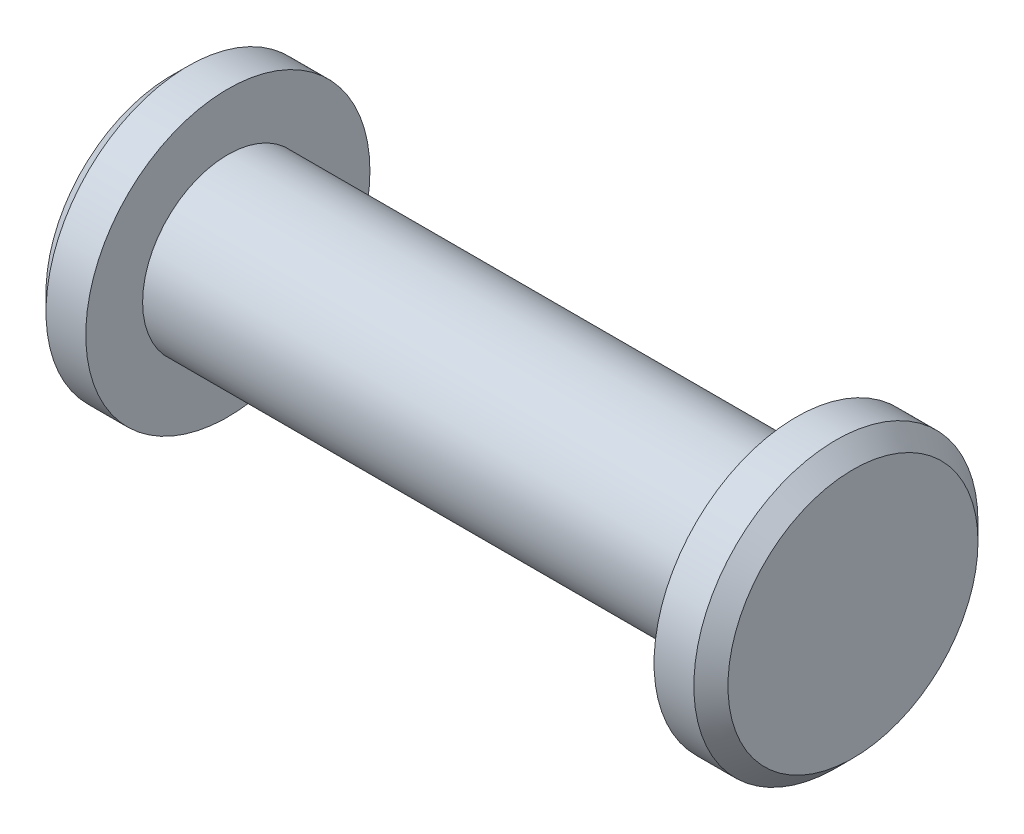
ISO-10303-21;
HEADER;
FILE_DESCRIPTION(('STEP AP214'),'2;1');
FILE_NAME('part.step','',(''),(''),'','','');
FILE_SCHEMA(('AUTOMOTIVE_DESIGN { 1 0 10303 214 1 1 1 1 }'));
ENDSEC;
DATA;
#1=APPLICATION_CONTEXT('core data for automotive mechanical design processes');
#2=APPLICATION_PROTOCOL_DEFINITION('international standard','automotive_design',2000,#1);
#3=PRODUCT_CONTEXT('',#1,'mechanical');
#4=PRODUCT('Part','Part','',(#3));
#5=PRODUCT_RELATED_PRODUCT_CATEGORY('part','',(#4));
#6=PRODUCT_DEFINITION_FORMATION('','',#4);
#7=PRODUCT_DEFINITION_CONTEXT('part definition',#1,'design');
#8=PRODUCT_DEFINITION('design','',#6,#7);
#9=PRODUCT_DEFINITION_SHAPE('','',#8);
#10=(LENGTH_UNIT() NAMED_UNIT(*) SI_UNIT(.MILLI.,.METRE.));
#11=(NAMED_UNIT(*) PLANE_ANGLE_UNIT() SI_UNIT($,.RADIAN.));
#12=(NAMED_UNIT(*) SI_UNIT($,.STERADIAN.) SOLID_ANGLE_UNIT());
#13=UNCERTAINTY_MEASURE_WITH_UNIT(LENGTH_MEASURE(1.E-05),#10,'distance_accuracy_value','');
#14=(GEOMETRIC_REPRESENTATION_CONTEXT(3) GLOBAL_UNCERTAINTY_ASSIGNED_CONTEXT((#13)) GLOBAL_UNIT_ASSIGNED_CONTEXT((#10,
#11,#12)) REPRESENTATION_CONTEXT('',''));
#15=CARTESIAN_POINT('',(0.,0.,0.));
#16=DIRECTION('',(0.,0.,1.));
#17=DIRECTION('',(1.,0.,0.));
#18=AXIS2_PLACEMENT_3D('',#15,#16,#17);
#19=CARTESIAN_POINT('',(50.,15.,0.));
#20=DIRECTION('',(-1.,0.,0.));
#21=DIRECTION('',(0.,0.,1.));
#22=AXIS2_PLACEMENT_3D('',#19,#20,#21);
#23=PLANE('',#22);
#24=CARTESIAN_POINT('',(50.,0.,0.));
#25=DIRECTION('',(1.,0.,0.));
#26=DIRECTION('',(0.,0.,-1.));
#27=AXIS2_PLACEMENT_3D('',#24,#25,#26);
#28=CIRCLE('',#27,15.);
#29=CARTESIAN_POINT('',(50.,0.,-15.));
#30=VERTEX_POINT('',#29);
#31=EDGE_CURVE('E72',#30,#30,#28,.T.);
#32=ORIENTED_EDGE('',*,*,#31,.T.);
#33=EDGE_LOOP('',(#32));
#34=FACE_BOUND('',#33,.T.);
#35=CARTESIAN_POINT('',(50.,0.,0.));
#36=DIRECTION('',(1.,0.,0.));
#37=DIRECTION('',(0.,0.,-1.));
#38=AXIS2_PLACEMENT_3D('',#35,#36,#37);
#39=CIRCLE('',#38,25.);
#40=CARTESIAN_POINT('',(50.,0.,-25.));
#41=VERTEX_POINT('',#40);
#42=EDGE_CURVE('E10',#41,#41,#39,.T.);
#43=ORIENTED_EDGE('',*,*,#42,.F.);
#44=EDGE_LOOP('',(#43));
#45=FACE_BOUND('',#44,.T.);
#46=ADVANCED_FACE('F37',(#34,#45),#23,.T.);
#47=CARTESIAN_POINT('',(60.,0.,0.));
#48=DIRECTION('',(1.,0.,0.));
#49=DIRECTION('',(0.,0.,-1.));
#50=AXIS2_PLACEMENT_3D('',#47,#48,#49);
#51=CYLINDRICAL_SURFACE('',#50,25.);
#52=ORIENTED_EDGE('',*,*,#42,.T.);
#53=EDGE_LOOP('',(#52));
#54=FACE_BOUND('',#53,.T.);
#55=CARTESIAN_POINT('',(57.,0.,0.));
#56=DIRECTION('',(1.,0.,0.));
#57=DIRECTION('',(0.,0.,-1.));
#58=AXIS2_PLACEMENT_3D('',#55,#56,#57);
#59=CIRCLE('',#58,25.);
#60=CARTESIAN_POINT('',(57.,0.,-25.));
#61=VERTEX_POINT('',#60);
#62=EDGE_CURVE('E44',#61,#61,#59,.T.);
#63=ORIENTED_EDGE('',*,*,#62,.F.);
#64=EDGE_LOOP('',(#63));
#65=FACE_BOUND('',#64,.T.);
#66=ADVANCED_FACE('F91',(#54,#65),#51,.T.);
#67=CARTESIAN_POINT('',(60.,0.,0.));
#68=DIRECTION('',(-1.,0.,0.));
#69=DIRECTION('',(0.,0.,1.));
#70=AXIS2_PLACEMENT_3D('',#67,#68,#69);
#71=CONICAL_SURFACE('',#70,22.,0.785398163397448);
#72=ORIENTED_EDGE('',*,*,#62,.T.);
#73=EDGE_LOOP('',(#72));
#74=FACE_BOUND('',#73,.T.);
#75=CARTESIAN_POINT('',(60.,0.,0.));
#76=DIRECTION('',(1.,0.,0.));
#77=DIRECTION('',(0.,0.,-1.));
#78=AXIS2_PLACEMENT_3D('',#75,#76,#77);
#79=CIRCLE('',#78,22.);
#80=CARTESIAN_POINT('',(60.,0.,-22.));
#81=VERTEX_POINT('',#80);
#82=EDGE_CURVE('E49',#81,#81,#79,.T.);
#83=ORIENTED_EDGE('',*,*,#82,.F.);
#84=EDGE_LOOP('',(#83));
#85=FACE_BOUND('',#84,.T.);
#86=ADVANCED_FACE('F95',(#74,#85),#71,.T.);
#87=CARTESIAN_POINT('',(60.,22.,0.));
#88=DIRECTION('',(1.,0.,0.));
#89=DIRECTION('',(0.,0.,-1.));
#90=AXIS2_PLACEMENT_3D('',#87,#88,#89);
#91=PLANE('',#90);
#92=ORIENTED_EDGE('',*,*,#82,.T.);
#93=EDGE_LOOP('',(#92));
#94=FACE_BOUND('',#93,.T.);
#95=ADVANCED_FACE('F99',(#94),#91,.T.);
#96=CARTESIAN_POINT('',(-60.,22.,0.));
#97=DIRECTION('',(-1.,0.,0.));
#98=DIRECTION('',(0.,0.,1.));
#99=AXIS2_PLACEMENT_3D('',#96,#97,#98);
#100=PLANE('',#99);
#101=CARTESIAN_POINT('',(-60.,0.,0.));
#102=DIRECTION('',(1.,0.,0.));
#103=DIRECTION('',(0.,0.,-1.));
#104=AXIS2_PLACEMENT_3D('',#101,#102,#103);
#105=CIRCLE('',#104,22.);
#106=CARTESIAN_POINT('',(-60.,0.,-22.));
#107=VERTEX_POINT('',#106);
#108=EDGE_CURVE('E54',#107,#107,#105,.T.);
#109=ORIENTED_EDGE('',*,*,#108,.F.);
#110=EDGE_LOOP('',(#109));
#111=FACE_BOUND('',#110,.T.);
#112=ADVANCED_FACE('F105',(#111),#100,.T.);
#113=CARTESIAN_POINT('',(-57.,0.,0.));
#114=DIRECTION('',(1.,0.,0.));
#115=DIRECTION('',(0.,0.,-1.));
#116=AXIS2_PLACEMENT_3D('',#113,#114,#115);
#117=CONICAL_SURFACE('',#116,25.,0.785398163397448);
#118=ORIENTED_EDGE('',*,*,#108,.T.);
#119=EDGE_LOOP('',(#118));
#120=FACE_BOUND('',#119,.T.);
#121=CARTESIAN_POINT('',(-57.,0.,0.));
#122=DIRECTION('',(1.,0.,0.));
#123=DIRECTION('',(0.,0.,-1.));
#124=AXIS2_PLACEMENT_3D('',#121,#122,#123);
#125=CIRCLE('',#124,25.);
#126=CARTESIAN_POINT('',(-57.,0.,-25.));
#127=VERTEX_POINT('',#126);
#128=EDGE_CURVE('E60',#127,#127,#125,.T.);
#129=ORIENTED_EDGE('',*,*,#128,.F.);
#130=EDGE_LOOP('',(#129));
#131=FACE_BOUND('',#130,.T.);
#132=ADVANCED_FACE('F109',(#120,#131),#117,.T.);
#133=CARTESIAN_POINT('',(60.,0.,0.));
#134=DIRECTION('',(1.,0.,0.));
#135=DIRECTION('',(0.,0.,-1.));
#136=AXIS2_PLACEMENT_3D('',#133,#134,#135);
#137=CYLINDRICAL_SURFACE('',#136,25.);
#138=ORIENTED_EDGE('',*,*,#128,.T.);
#139=EDGE_LOOP('',(#138));
#140=FACE_BOUND('',#139,.T.);
#141=CARTESIAN_POINT('',(-50.,0.,0.));
#142=DIRECTION('',(1.,0.,0.));
#143=DIRECTION('',(0.,0.,-1.));
#144=AXIS2_PLACEMENT_3D('',#141,#142,#143);
#145=CIRCLE('',#144,25.);
#146=CARTESIAN_POINT('',(-50.,0.,-25.));
#147=VERTEX_POINT('',#146);
#148=EDGE_CURVE('E64',#147,#147,#145,.T.);
#149=ORIENTED_EDGE('',*,*,#148,.F.);
#150=EDGE_LOOP('',(#149));
#151=FACE_BOUND('',#150,.T.);
#152=ADVANCED_FACE('F87',(#140,#151),#137,.T.);
#153=CARTESIAN_POINT('',(-50.,15.,0.));
#154=DIRECTION('',(1.,0.,0.));
#155=DIRECTION('',(0.,0.,-1.));
#156=AXIS2_PLACEMENT_3D('',#153,#154,#155);
#157=PLANE('',#156);
#158=ORIENTED_EDGE('',*,*,#148,.T.);
#159=EDGE_LOOP('',(#158));
#160=FACE_BOUND('',#159,.T.);
#161=CARTESIAN_POINT('',(-50.,0.,0.));
#162=DIRECTION('',(1.,0.,0.));
#163=DIRECTION('',(0.,0.,-1.));
#164=AXIS2_PLACEMENT_3D('',#161,#162,#163);
#165=CIRCLE('',#164,15.);
#166=CARTESIAN_POINT('',(-50.,0.,-15.));
#167=VERTEX_POINT('',#166);
#168=EDGE_CURVE('E68',#167,#167,#165,.T.);
#169=ORIENTED_EDGE('',*,*,#168,.F.);
#170=EDGE_LOOP('',(#169));
#171=FACE_BOUND('',#170,.T.);
#172=ADVANCED_FACE('F81',(#160,#171),#157,.T.);
#173=CARTESIAN_POINT('',(60.,0.,0.));
#174=DIRECTION('',(1.,0.,0.));
#175=DIRECTION('',(0.,0.,-1.));
#176=AXIS2_PLACEMENT_3D('',#173,#174,#175);
#177=CYLINDRICAL_SURFACE('',#176,15.);
#178=ORIENTED_EDGE('',*,*,#168,.T.);
#179=EDGE_LOOP('',(#178));
#180=FACE_BOUND('',#179,.T.);
#181=ORIENTED_EDGE('',*,*,#31,.F.);
#182=EDGE_LOOP('',(#181));
#183=FACE_BOUND('',#182,.T.);
#184=ADVANCED_FACE('F79',(#180,#183),#177,.T.);
#185=CLOSED_SHELL('',(#46,#66,#86,#95,#112,#132,#152,#172,#184));
#186=MANIFOLD_SOLID_BREP('B2',#185);
#187=ADVANCED_BREP_SHAPE_REPRESENTATION('',(#18,#186),#14);
#188=SHAPE_DEFINITION_REPRESENTATION(#9,#187);
ENDSEC;
END-ISO-10303-21;
